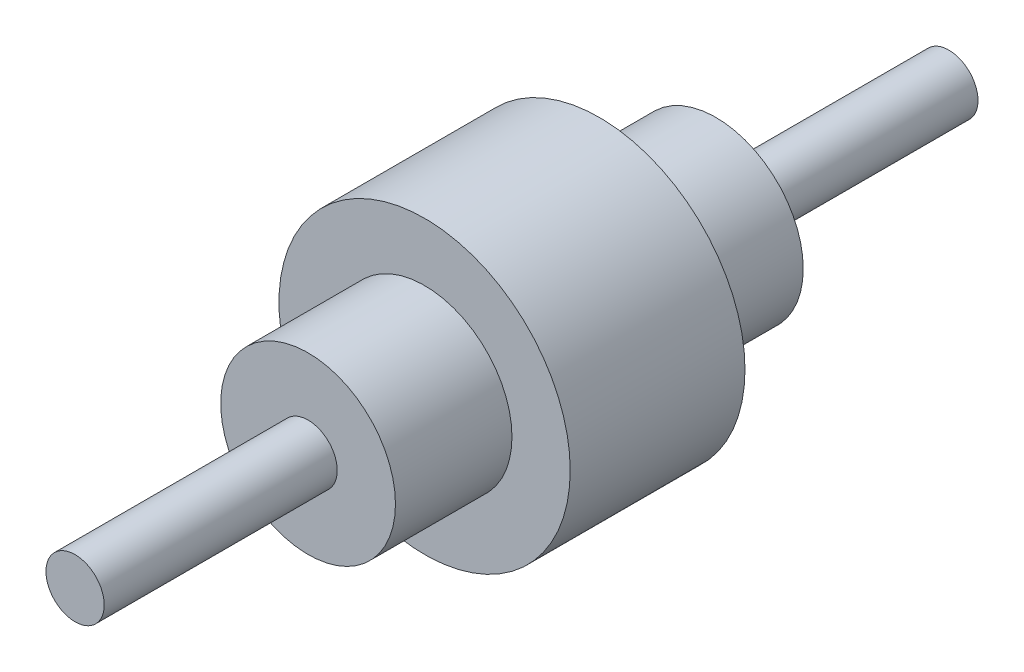
ISO-10303-21;
HEADER;
FILE_DESCRIPTION(('STEP AP214'),'2;1');
FILE_NAME('part.step','',(''),(''),'','','');
FILE_SCHEMA(('AUTOMOTIVE_DESIGN { 1 0 10303 214 1 1 1 1 }'));
ENDSEC;
DATA;
#1=APPLICATION_CONTEXT('core data for automotive mechanical design processes');
#2=APPLICATION_PROTOCOL_DEFINITION('international standard','automotive_design',2000,#1);
#3=PRODUCT_CONTEXT('',#1,'mechanical');
#4=PRODUCT('Part','Part','',(#3));
#5=PRODUCT_RELATED_PRODUCT_CATEGORY('part','',(#4));
#6=PRODUCT_DEFINITION_FORMATION('','',#4);
#7=PRODUCT_DEFINITION_CONTEXT('part definition',#1,'design');
#8=PRODUCT_DEFINITION('design','',#6,#7);
#9=PRODUCT_DEFINITION_SHAPE('','',#8);
#10=(LENGTH_UNIT() NAMED_UNIT(*) SI_UNIT(.MILLI.,.METRE.));
#11=(NAMED_UNIT(*) PLANE_ANGLE_UNIT() SI_UNIT($,.RADIAN.));
#12=(NAMED_UNIT(*) SI_UNIT($,.STERADIAN.) SOLID_ANGLE_UNIT());
#13=UNCERTAINTY_MEASURE_WITH_UNIT(LENGTH_MEASURE(1.E-05),#10,'distance_accuracy_value','');
#14=(GEOMETRIC_REPRESENTATION_CONTEXT(3) GLOBAL_UNCERTAINTY_ASSIGNED_CONTEXT((#13)) GLOBAL_UNIT_ASSIGNED_CONTEXT((#10,
#11,#12)) REPRESENTATION_CONTEXT('',''));
#15=CARTESIAN_POINT('',(0.,0.,0.));
#16=DIRECTION('',(0.,0.,1.));
#17=DIRECTION('',(1.,0.,0.));
#18=AXIS2_PLACEMENT_3D('',#15,#16,#17);
#19=CARTESIAN_POINT('',(0.,0.,-300.));
#20=DIRECTION('',(0.,0.,-1.));
#21=DIRECTION('',(-1.,0.,0.));
#22=AXIS2_PLACEMENT_3D('',#19,#20,#21);
#23=PLANE('',#22);
#24=CARTESIAN_POINT('',(0.,0.,-300.));
#25=DIRECTION('',(0.,0.,1.));
#26=DIRECTION('',(1.,0.,0.));
#27=AXIS2_PLACEMENT_3D('',#24,#25,#26);
#28=CIRCLE('',#27,10.);
#29=CARTESIAN_POINT('',(10.,0.,-300.));
#30=VERTEX_POINT('',#29);
#31=EDGE_CURVE('E10',#30,#30,#28,.T.);
#32=ORIENTED_EDGE('',*,*,#31,.F.);
#33=EDGE_LOOP('',(#32));
#34=FACE_BOUND('',#33,.T.);
#35=ADVANCED_FACE('F31',(#34),#23,.T.);
#36=CARTESIAN_POINT('',(0.,0.,0.));
#37=DIRECTION('',(0.,0.,1.));
#38=DIRECTION('',(1.,0.,0.));
#39=AXIS2_PLACEMENT_3D('',#36,#37,#38);
#40=CYLINDRICAL_SURFACE('',#39,10.);
#41=ORIENTED_EDGE('',*,*,#31,.T.);
#42=EDGE_LOOP('',(#41));
#43=FACE_BOUND('',#42,.T.);
#44=CARTESIAN_POINT('',(0.,0.,-220.));
#45=DIRECTION('',(0.,0.,1.));
#46=DIRECTION('',(1.,0.,0.));
#47=AXIS2_PLACEMENT_3D('',#44,#45,#46);
#48=CIRCLE('',#47,10.);
#49=CARTESIAN_POINT('',(10.,0.,-220.));
#50=VERTEX_POINT('',#49);
#51=EDGE_CURVE('E37',#50,#50,#48,.T.);
#52=ORIENTED_EDGE('',*,*,#51,.F.);
#53=EDGE_LOOP('',(#52));
#54=FACE_BOUND('',#53,.T.);
#55=ADVANCED_FACE('F85',(#43,#54),#40,.T.);
#56=CARTESIAN_POINT('',(10.,0.,-220.));
#57=DIRECTION('',(0.,0.,-1.));
#58=DIRECTION('',(-1.,0.,0.));
#59=AXIS2_PLACEMENT_3D('',#56,#57,#58);
#60=PLANE('',#59);
#61=ORIENTED_EDGE('',*,*,#51,.T.);
#62=EDGE_LOOP('',(#61));
#63=FACE_BOUND('',#62,.T.);
#64=CARTESIAN_POINT('',(0.,0.,-220.));
#65=DIRECTION('',(0.,0.,1.));
#66=DIRECTION('',(1.,0.,0.));
#67=AXIS2_PLACEMENT_3D('',#64,#65,#66);
#68=CIRCLE('',#67,30.);
#69=CARTESIAN_POINT('',(30.,0.,-220.));
#70=VERTEX_POINT('',#69);
#71=EDGE_CURVE('E41',#70,#70,#68,.T.);
#72=ORIENTED_EDGE('',*,*,#71,.F.);
#73=EDGE_LOOP('',(#72));
#74=FACE_BOUND('',#73,.T.);
#75=ADVANCED_FACE('F90',(#63,#74),#60,.T.);
#76=CARTESIAN_POINT('',(0.,0.,0.));
#77=DIRECTION('',(0.,0.,1.));
#78=DIRECTION('',(1.,0.,0.));
#79=AXIS2_PLACEMENT_3D('',#76,#77,#78);
#80=CYLINDRICAL_SURFACE('',#79,30.);
#81=ORIENTED_EDGE('',*,*,#71,.T.);
#82=EDGE_LOOP('',(#81));
#83=FACE_BOUND('',#82,.T.);
#84=CARTESIAN_POINT('',(0.,0.,-180.));
#85=DIRECTION('',(0.,0.,1.));
#86=DIRECTION('',(1.,0.,0.));
#87=AXIS2_PLACEMENT_3D('',#84,#85,#86);
#88=CIRCLE('',#87,30.);
#89=CARTESIAN_POINT('',(30.,0.,-180.));
#90=VERTEX_POINT('',#89);
#91=EDGE_CURVE('E45',#90,#90,#88,.T.);
#92=ORIENTED_EDGE('',*,*,#91,.F.);
#93=EDGE_LOOP('',(#92));
#94=FACE_BOUND('',#93,.T.);
#95=ADVANCED_FACE('F94',(#83,#94),#80,.T.);
#96=CARTESIAN_POINT('',(30.,0.,-180.));
#97=DIRECTION('',(0.,0.,-1.));
#98=DIRECTION('',(-1.,0.,0.));
#99=AXIS2_PLACEMENT_3D('',#96,#97,#98);
#100=PLANE('',#99);
#101=ORIENTED_EDGE('',*,*,#91,.T.);
#102=EDGE_LOOP('',(#101));
#103=FACE_BOUND('',#102,.T.);
#104=CARTESIAN_POINT('',(0.,0.,-180.));
#105=DIRECTION('',(0.,0.,1.));
#106=DIRECTION('',(1.,0.,0.));
#107=AXIS2_PLACEMENT_3D('',#104,#105,#106);
#108=CIRCLE('',#107,50.);
#109=CARTESIAN_POINT('',(50.,0.,-180.));
#110=VERTEX_POINT('',#109);
#111=EDGE_CURVE('E50',#110,#110,#108,.T.);
#112=ORIENTED_EDGE('',*,*,#111,.F.);
#113=EDGE_LOOP('',(#112));
#114=FACE_BOUND('',#113,.T.);
#115=ADVANCED_FACE('F100',(#103,#114),#100,.T.);
#116=CARTESIAN_POINT('',(0.,0.,0.));
#117=DIRECTION('',(0.,0.,1.));
#118=DIRECTION('',(1.,0.,0.));
#119=AXIS2_PLACEMENT_3D('',#116,#117,#118);
#120=CYLINDRICAL_SURFACE('',#119,50.);
#121=ORIENTED_EDGE('',*,*,#111,.T.);
#122=EDGE_LOOP('',(#121));
#123=FACE_BOUND('',#122,.T.);
#124=CARTESIAN_POINT('',(0.,0.,-120.));
#125=DIRECTION('',(0.,0.,1.));
#126=DIRECTION('',(1.,0.,0.));
#127=AXIS2_PLACEMENT_3D('',#124,#125,#126);
#128=CIRCLE('',#127,50.);
#129=CARTESIAN_POINT('',(50.,0.,-120.));
#130=VERTEX_POINT('',#129);
#131=EDGE_CURVE('E53',#130,#130,#128,.T.);
#132=ORIENTED_EDGE('',*,*,#131,.F.);
#133=EDGE_LOOP('',(#132));
#134=FACE_BOUND('',#133,.T.);
#135=ADVANCED_FACE('F104',(#123,#134),#120,.T.);
#136=CARTESIAN_POINT('',(50.,0.,-120.));
#137=DIRECTION('',(0.,0.,1.));
#138=DIRECTION('',(1.,0.,0.));
#139=AXIS2_PLACEMENT_3D('',#136,#137,#138);
#140=PLANE('',#139);
#141=ORIENTED_EDGE('',*,*,#131,.T.);
#142=EDGE_LOOP('',(#141));
#143=FACE_BOUND('',#142,.T.);
#144=CARTESIAN_POINT('',(0.,0.,-120.));
#145=DIRECTION('',(0.,0.,1.));
#146=DIRECTION('',(1.,0.,0.));
#147=AXIS2_PLACEMENT_3D('',#144,#145,#146);
#148=CIRCLE('',#147,30.);
#149=CARTESIAN_POINT('',(30.,0.,-120.));
#150=VERTEX_POINT('',#149);
#151=EDGE_CURVE('E56',#150,#150,#148,.T.);
#152=ORIENTED_EDGE('',*,*,#151,.F.);
#153=EDGE_LOOP('',(#152));
#154=FACE_BOUND('',#153,.T.);
#155=ADVANCED_FACE('F108',(#143,#154),#140,.T.);
#156=CARTESIAN_POINT('',(0.,0.,0.));
#157=DIRECTION('',(0.,0.,1.));
#158=DIRECTION('',(1.,0.,0.));
#159=AXIS2_PLACEMENT_3D('',#156,#157,#158);
#160=CYLINDRICAL_SURFACE('',#159,30.);
#161=ORIENTED_EDGE('',*,*,#151,.T.);
#162=EDGE_LOOP('',(#161));
#163=FACE_BOUND('',#162,.T.);
#164=CARTESIAN_POINT('',(0.,0.,-80.));
#165=DIRECTION('',(0.,0.,1.));
#166=DIRECTION('',(1.,0.,0.));
#167=AXIS2_PLACEMENT_3D('',#164,#165,#166);
#168=CIRCLE('',#167,30.);
#169=CARTESIAN_POINT('',(30.,0.,-80.));
#170=VERTEX_POINT('',#169);
#171=EDGE_CURVE('E59',#170,#170,#168,.T.);
#172=ORIENTED_EDGE('',*,*,#171,.F.);
#173=EDGE_LOOP('',(#172));
#174=FACE_BOUND('',#173,.T.);
#175=ADVANCED_FACE('F81',(#163,#174),#160,.T.);
#176=CARTESIAN_POINT('',(30.,0.,-80.));
#177=DIRECTION('',(0.,0.,1.));
#178=DIRECTION('',(1.,0.,0.));
#179=AXIS2_PLACEMENT_3D('',#176,#177,#178);
#180=PLANE('',#179);
#181=ORIENTED_EDGE('',*,*,#171,.T.);
#182=EDGE_LOOP('',(#181));
#183=FACE_BOUND('',#182,.T.);
#184=CARTESIAN_POINT('',(0.,0.,-80.));
#185=DIRECTION('',(0.,0.,1.));
#186=DIRECTION('',(1.,0.,0.));
#187=AXIS2_PLACEMENT_3D('',#184,#185,#186);
#188=CIRCLE('',#187,9.99999999999999);
#189=CARTESIAN_POINT('',(9.99999999999999,0.,-80.));
#190=VERTEX_POINT('',#189);
#191=EDGE_CURVE('E62',#190,#190,#188,.T.);
#192=ORIENTED_EDGE('',*,*,#191,.F.);
#193=EDGE_LOOP('',(#192));
#194=FACE_BOUND('',#193,.T.);
#195=ADVANCED_FACE('F73',(#183,#194),#180,.T.);
#196=CARTESIAN_POINT('',(0.,0.,0.));
#197=DIRECTION('',(0.,0.,1.));
#198=DIRECTION('',(1.,0.,0.));
#199=AXIS2_PLACEMENT_3D('',#196,#197,#198);
#200=CYLINDRICAL_SURFACE('',#199,9.99999999999999);
#201=ORIENTED_EDGE('',*,*,#191,.T.);
#202=EDGE_LOOP('',(#201));
#203=FACE_BOUND('',#202,.T.);
#204=CARTESIAN_POINT('',(0.,0.,0.));
#205=DIRECTION('',(0.,0.,1.));
#206=DIRECTION('',(1.,0.,0.));
#207=AXIS2_PLACEMENT_3D('',#204,#205,#206);
#208=CIRCLE('',#207,10.);
#209=CARTESIAN_POINT('',(10.,0.,0.));
#210=VERTEX_POINT('',#209);
#211=EDGE_CURVE('E65',#210,#210,#208,.T.);
#212=ORIENTED_EDGE('',*,*,#211,.F.);
#213=EDGE_LOOP('',(#212));
#214=FACE_BOUND('',#213,.T.);
#215=ADVANCED_FACE('F71',(#203,#214),#200,.T.);
#216=CARTESIAN_POINT('',(10.,0.,0.));
#217=DIRECTION('',(0.,0.,1.));
#218=DIRECTION('',(1.,0.,0.));
#219=AXIS2_PLACEMENT_3D('',#216,#217,#218);
#220=PLANE('',#219);
#221=ORIENTED_EDGE('',*,*,#211,.T.);
#222=EDGE_LOOP('',(#221));
#223=FACE_BOUND('',#222,.T.);
#224=ADVANCED_FACE('F69',(#223),#220,.T.);
#225=CLOSED_SHELL('',(#35,#55,#75,#95,#115,#135,#155,#175,#195,#215,#224));
#226=MANIFOLD_SOLID_BREP('B2',#225);
#227=ADVANCED_BREP_SHAPE_REPRESENTATION('',(#18,#226),#14);
#228=SHAPE_DEFINITION_REPRESENTATION(#9,#227);
ENDSEC;
END-ISO-10303-21;
